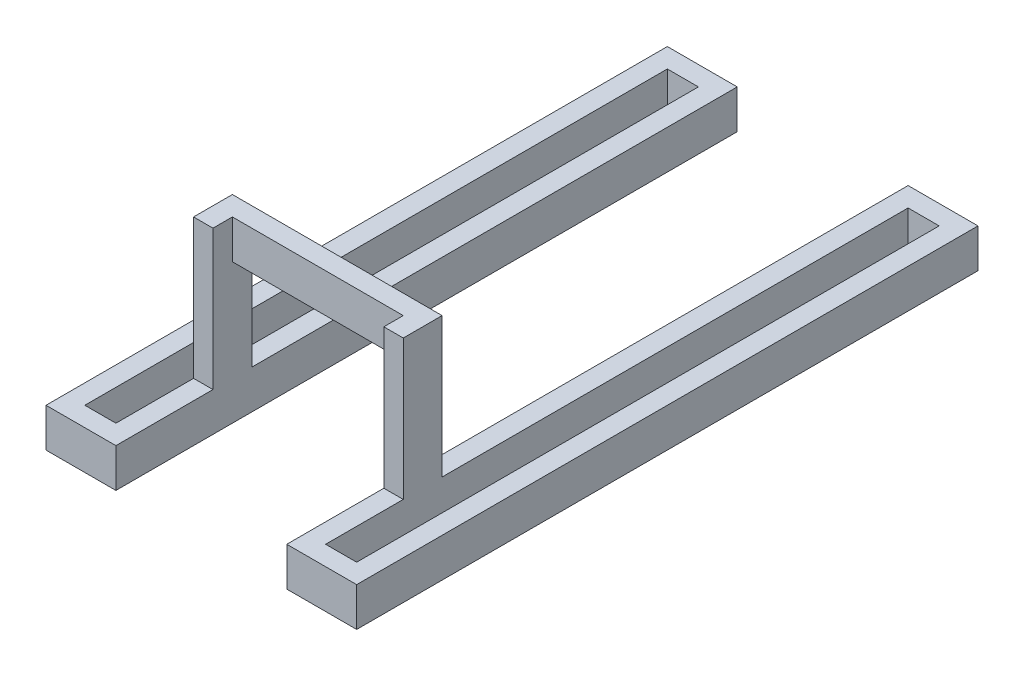
ISO-10303-21;
HEADER;
FILE_DESCRIPTION(('STEP AP214'),'2;1');
FILE_NAME('part.step','',(''),(''),'','','');
FILE_SCHEMA(('AUTOMOTIVE_DESIGN { 1 0 10303 214 1 1 1 1 }'));
ENDSEC;
DATA;
#1=APPLICATION_CONTEXT('core data for automotive mechanical design processes');
#2=APPLICATION_PROTOCOL_DEFINITION('international standard','automotive_design',2000,#1);
#3=PRODUCT_CONTEXT('',#1,'mechanical');
#4=PRODUCT('Part','Part','',(#3));
#5=PRODUCT_RELATED_PRODUCT_CATEGORY('part','',(#4));
#6=PRODUCT_DEFINITION_FORMATION('','',#4);
#7=PRODUCT_DEFINITION_CONTEXT('part definition',#1,'design');
#8=PRODUCT_DEFINITION('design','',#6,#7);
#9=PRODUCT_DEFINITION_SHAPE('','',#8);
#10=(LENGTH_UNIT() NAMED_UNIT(*) SI_UNIT(.MILLI.,.METRE.));
#11=(NAMED_UNIT(*) PLANE_ANGLE_UNIT() SI_UNIT($,.RADIAN.));
#12=(NAMED_UNIT(*) SI_UNIT($,.STERADIAN.) SOLID_ANGLE_UNIT());
#13=UNCERTAINTY_MEASURE_WITH_UNIT(LENGTH_MEASURE(1.E-05),#10,'distance_accuracy_value','');
#14=(GEOMETRIC_REPRESENTATION_CONTEXT(3) GLOBAL_UNCERTAINTY_ASSIGNED_CONTEXT((#13)) GLOBAL_UNIT_ASSIGNED_CONTEXT((#10,
#11,#12)) REPRESENTATION_CONTEXT('',''));
#15=CARTESIAN_POINT('',(0.,0.,0.));
#16=DIRECTION('',(0.,0.,1.));
#17=DIRECTION('',(1.,0.,0.));
#18=AXIS2_PLACEMENT_3D('',#15,#16,#17);
#19=CARTESIAN_POINT('',(-135.,180.,-55.9016994374948));
#20=DIRECTION('',(0.,-1.,0.));
#21=DIRECTION('',(0.,0.,-1.));
#22=AXIS2_PLACEMENT_3D('',#19,#20,#21);
#23=PLANE('',#22);
#24=DIRECTION('',(0.,0.,-1.));
#25=VECTOR('',#24,1.);
#26=CARTESIAN_POINT('',(110.,180.,-55.9016994374948));
#27=LINE('',#26,#25);
#28=CARTESIAN_POINT('',(110.,180.,650.));
#29=VERTEX_POINT('',#28);
#30=CARTESIAN_POINT('',(110.,180.,625.));
#31=VERTEX_POINT('',#30);
#32=EDGE_CURVE('E408',#29,#31,#27,.T.);
#33=ORIENTED_EDGE('',*,*,#32,.F.);
#34=DIRECTION('',(1.,0.,0.));
#35=VECTOR('',#34,1.);
#36=CARTESIAN_POINT('',(-190.901699437495,180.,650.));
#37=LINE('',#36,#35);
#38=CARTESIAN_POINT('',(-110.,180.,650.));
#39=VERTEX_POINT('',#38);
#40=EDGE_CURVE('E365',#39,#29,#37,.T.);
#41=ORIENTED_EDGE('',*,*,#40,.F.);
#42=DIRECTION('',(0.,0.,1.));
#43=VECTOR('',#42,1.);
#44=CARTESIAN_POINT('',(-110.,180.,-55.9016994374948));
#45=LINE('',#44,#43);
#46=CARTESIAN_POINT('',(-110.,180.,625.));
#47=VERTEX_POINT('',#46);
#48=EDGE_CURVE('E11',#47,#39,#45,.T.);
#49=ORIENTED_EDGE('',*,*,#48,.F.);
#50=DIRECTION('',(1.,0.,0.));
#51=VECTOR('',#50,1.);
#52=CARTESIAN_POINT('',(-190.901699437495,180.,625.));
#53=LINE('',#52,#51);
#54=EDGE_CURVE('E372',#47,#31,#53,.T.);
#55=ORIENTED_EDGE('',*,*,#54,.T.);
#56=EDGE_LOOP('',(#33,#41,#49,#55));
#57=FACE_BOUND('',#56,.T.);
#58=ADVANCED_FACE('F32',(#57),#23,.T.);
#59=CARTESIAN_POINT('',(-190.901699437495,230.,650.));
#60=DIRECTION('',(0.,0.,1.));
#61=DIRECTION('',(1.,0.,0.));
#62=AXIS2_PLACEMENT_3D('',#59,#60,#61);
#63=PLANE('',#62);
#64=ORIENTED_EDGE('',*,*,#40,.T.);
#65=DIRECTION('',(0.,1.,0.));
#66=VECTOR('',#65,1.);
#67=CARTESIAN_POINT('',(110.,230.,650.));
#68=LINE('',#67,#66);
#69=CARTESIAN_POINT('',(110.,230.,650.));
#70=VERTEX_POINT('',#69);
#71=EDGE_CURVE('E359',#29,#70,#68,.T.);
#72=ORIENTED_EDGE('',*,*,#71,.T.);
#73=DIRECTION('',(1.,0.,0.));
#74=VECTOR('',#73,1.);
#75=CARTESIAN_POINT('',(-190.901699437495,230.,650.));
#76=LINE('',#75,#74);
#77=CARTESIAN_POINT('',(-110.,230.,650.));
#78=VERTEX_POINT('',#77);
#79=EDGE_CURVE('E366',#78,#70,#76,.T.);
#80=ORIENTED_EDGE('',*,*,#79,.F.);
#81=DIRECTION('',(0.,1.,0.));
#82=VECTOR('',#81,1.);
#83=CARTESIAN_POINT('',(-110.,50.,650.));
#84=LINE('',#83,#82);
#85=EDGE_CURVE('E369',#39,#78,#84,.T.);
#86=ORIENTED_EDGE('',*,*,#85,.F.);
#87=EDGE_LOOP('',(#64,#72,#80,#86));
#88=FACE_BOUND('',#87,.T.);
#89=ADVANCED_FACE('F446',(#88),#63,.T.);
#90=CARTESIAN_POINT('',(-190.901699437495,230.,625.));
#91=DIRECTION('',(0.,0.,-1.));
#92=DIRECTION('',(-1.,0.,0.));
#93=AXIS2_PLACEMENT_3D('',#90,#91,#92);
#94=PLANE('',#93);
#95=DIRECTION('',(1.,0.,0.));
#96=VECTOR('',#95,1.);
#97=CARTESIAN_POINT('',(-190.901699437495,230.,625.));
#98=LINE('',#97,#96);
#99=CARTESIAN_POINT('',(-135.,230.,625.));
#100=VERTEX_POINT('',#99);
#101=CARTESIAN_POINT('',(135.,230.,625.));
#102=VERTEX_POINT('',#101);
#103=EDGE_CURVE('E370',#100,#102,#98,.T.);
#104=ORIENTED_EDGE('',*,*,#103,.T.);
#105=DIRECTION('',(0.,1.,0.));
#106=VECTOR('',#105,1.);
#107=CARTESIAN_POINT('',(135.,-5.90169943749475,625.));
#108=LINE('',#107,#106);
#109=CARTESIAN_POINT('',(135.,50.,625.));
#110=VERTEX_POINT('',#109);
#111=EDGE_CURVE('E403',#110,#102,#108,.T.);
#112=ORIENTED_EDGE('',*,*,#111,.F.);
#113=DIRECTION('',(-1.,0.,0.));
#114=VECTOR('',#113,1.);
#115=CARTESIAN_POINT('',(135.,50.,625.));
#116=LINE('',#115,#114);
#117=CARTESIAN_POINT('',(110.,50.,625.));
#118=VERTEX_POINT('',#117);
#119=EDGE_CURVE('E406',#110,#118,#116,.T.);
#120=ORIENTED_EDGE('',*,*,#119,.T.);
#121=DIRECTION('',(0.,1.,0.));
#122=VECTOR('',#121,1.);
#123=CARTESIAN_POINT('',(110.,-5.90169943749475,625.));
#124=LINE('',#123,#122);
#125=EDGE_CURVE('E415',#118,#31,#124,.T.);
#126=ORIENTED_EDGE('',*,*,#125,.T.);
#127=ORIENTED_EDGE('',*,*,#54,.F.);
#128=DIRECTION('',(0.,1.,0.));
#129=VECTOR('',#128,1.);
#130=CARTESIAN_POINT('',(-110.,-5.9016994374948,625.));
#131=LINE('',#130,#129);
#132=CARTESIAN_POINT('',(-110.,50.,625.));
#133=VERTEX_POINT('',#132);
#134=EDGE_CURVE('E287',#133,#47,#131,.T.);
#135=ORIENTED_EDGE('',*,*,#134,.F.);
#136=DIRECTION('',(-1.,0.,0.));
#137=VECTOR('',#136,1.);
#138=CARTESIAN_POINT('',(-110.,50.,625.));
#139=LINE('',#138,#137);
#140=CARTESIAN_POINT('',(-135.,50.,625.));
#141=VERTEX_POINT('',#140);
#142=EDGE_CURVE('E284',#133,#141,#139,.T.);
#143=ORIENTED_EDGE('',*,*,#142,.T.);
#144=DIRECTION('',(0.,1.,0.));
#145=VECTOR('',#144,1.);
#146=CARTESIAN_POINT('',(-135.,-5.9016994374948,625.));
#147=LINE('',#146,#145);
#148=EDGE_CURVE('E55',#141,#100,#147,.T.);
#149=ORIENTED_EDGE('',*,*,#148,.T.);
#150=EDGE_LOOP('',(#104,#112,#120,#126,#127,#135,#143,#149));
#151=FACE_BOUND('',#150,.T.);
#152=ADVANCED_FACE('F401',(#151),#94,.T.);
#153=CARTESIAN_POINT('',(-200.,50.,800.));
#154=DIRECTION('',(1.,0.,0.));
#155=DIRECTION('',(0.,0.,-1.));
#156=AXIS2_PLACEMENT_3D('',#153,#154,#155);
#157=PLANE('',#156);
#158=DIRECTION('',(0.,-1.,0.));
#159=VECTOR('',#158,1.);
#160=CARTESIAN_POINT('',(-200.,50.,0.));
#161=LINE('',#160,#159);
#162=CARTESIAN_POINT('',(-200.,50.,0.));
#163=VERTEX_POINT('',#162);
#164=CARTESIAN_POINT('',(-200.,0.,0.));
#165=VERTEX_POINT('',#164);
#166=EDGE_CURVE('E258',#163,#165,#161,.T.);
#167=ORIENTED_EDGE('',*,*,#166,.T.);
#168=DIRECTION('',(0.,0.,-1.));
#169=VECTOR('',#168,1.);
#170=CARTESIAN_POINT('',(-200.,0.,800.));
#171=LINE('',#170,#169);
#172=CARTESIAN_POINT('',(-200.,0.,800.));
#173=VERTEX_POINT('',#172);
#174=EDGE_CURVE('E40',#173,#165,#171,.T.);
#175=ORIENTED_EDGE('',*,*,#174,.F.);
#176=DIRECTION('',(0.,-1.,0.));
#177=VECTOR('',#176,1.);
#178=CARTESIAN_POINT('',(-200.,50.,800.));
#179=LINE('',#178,#177);
#180=CARTESIAN_POINT('',(-200.,50.,800.));
#181=VERTEX_POINT('',#180);
#182=EDGE_CURVE('E259',#181,#173,#179,.T.);
#183=ORIENTED_EDGE('',*,*,#182,.F.);
#184=DIRECTION('',(0.,0.,-1.));
#185=VECTOR('',#184,1.);
#186=CARTESIAN_POINT('',(-200.,50.,800.));
#187=LINE('',#186,#185);
#188=EDGE_CURVE('E213',#181,#163,#187,.T.);
#189=ORIENTED_EDGE('',*,*,#188,.T.);
#190=EDGE_LOOP('',(#167,#175,#183,#189));
#191=FACE_BOUND('',#190,.T.);
#192=ADVANCED_FACE('F34',(#191),#157,.F.);
#193=CARTESIAN_POINT('',(-200.,0.,800.));
#194=DIRECTION('',(0.,1.,0.));
#195=DIRECTION('',(0.,0.,1.));
#196=AXIS2_PLACEMENT_3D('',#193,#194,#195);
#197=PLANE('',#196);
#198=ORIENTED_EDGE('',*,*,#174,.T.);
#199=DIRECTION('',(1.,0.,0.));
#200=VECTOR('',#199,1.);
#201=CARTESIAN_POINT('',(-200.,0.,0.));
#202=LINE('',#201,#200);
#203=CARTESIAN_POINT('',(-110.,0.,0.));
#204=VERTEX_POINT('',#203);
#205=EDGE_CURVE('E265',#165,#204,#202,.T.);
#206=ORIENTED_EDGE('',*,*,#205,.T.);
#207=DIRECTION('',(0.,0.,-1.));
#208=VECTOR('',#207,1.);
#209=CARTESIAN_POINT('',(-110.,0.,800.));
#210=LINE('',#209,#208);
#211=CARTESIAN_POINT('',(-110.,0.,800.));
#212=VERTEX_POINT('',#211);
#213=EDGE_CURVE('E227',#212,#204,#210,.T.);
#214=ORIENTED_EDGE('',*,*,#213,.F.);
#215=DIRECTION('',(1.,0.,0.));
#216=VECTOR('',#215,1.);
#217=CARTESIAN_POINT('',(-200.,0.,800.));
#218=LINE('',#217,#216);
#219=EDGE_CURVE('E218',#173,#212,#218,.T.);
#220=ORIENTED_EDGE('',*,*,#219,.F.);
#221=EDGE_LOOP('',(#198,#206,#214,#220));
#222=FACE_BOUND('',#221,.T.);
#223=DIRECTION('',(0.,0.,-1.));
#224=VECTOR('',#223,1.);
#225=CARTESIAN_POINT('',(-175.,0.,800.));
#226=LINE('',#225,#224);
#227=CARTESIAN_POINT('',(-175.,0.,775.));
#228=VERTEX_POINT('',#227);
#229=CARTESIAN_POINT('',(-175.,0.,25.));
#230=VERTEX_POINT('',#229);
#231=EDGE_CURVE('E271',#228,#230,#226,.T.);
#232=ORIENTED_EDGE('',*,*,#231,.F.);
#233=DIRECTION('',(-1.,0.,0.));
#234=VECTOR('',#233,1.);
#235=CARTESIAN_POINT('',(-79.0983005625052,0.,775.));
#236=LINE('',#235,#234);
#237=CARTESIAN_POINT('',(-135.,0.,775.));
#238=VERTEX_POINT('',#237);
#239=EDGE_CURVE('E381',#238,#228,#236,.T.);
#240=ORIENTED_EDGE('',*,*,#239,.F.);
#241=DIRECTION('',(0.,0.,-1.));
#242=VECTOR('',#241,1.);
#243=CARTESIAN_POINT('',(-135.,0.,800.));
#244=LINE('',#243,#242);
#245=CARTESIAN_POINT('',(-135.,0.,25.));
#246=VERTEX_POINT('',#245);
#247=EDGE_CURVE('E244',#238,#246,#244,.T.);
#248=ORIENTED_EDGE('',*,*,#247,.T.);
#249=DIRECTION('',(-1.,0.,0.));
#250=VECTOR('',#249,1.);
#251=CARTESIAN_POINT('',(-79.0983005625052,0.,25.));
#252=LINE('',#251,#250);
#253=EDGE_CURVE('E246',#246,#230,#252,.T.);
#254=ORIENTED_EDGE('',*,*,#253,.T.);
#255=EDGE_LOOP('',(#232,#240,#248,#254));
#256=FACE_BOUND('',#255,.T.);
#257=ADVANCED_FACE('F275',(#222,#256),#197,.F.);
#258=CARTESIAN_POINT('',(-175.,50.,800.));
#259=DIRECTION('',(-1.,0.,0.));
#260=DIRECTION('',(0.,-1.,0.));
#261=AXIS2_PLACEMENT_3D('',#258,#259,#260);
#262=PLANE('',#261);
#263=DIRECTION('',(0.,0.,-1.));
#264=VECTOR('',#263,1.);
#265=CARTESIAN_POINT('',(-175.,50.,800.));
#266=LINE('',#265,#264);
#267=CARTESIAN_POINT('',(-175.,50.,775.));
#268=VERTEX_POINT('',#267);
#269=CARTESIAN_POINT('',(-175.,50.,25.));
#270=VERTEX_POINT('',#269);
#271=EDGE_CURVE('E269',#268,#270,#266,.T.);
#272=ORIENTED_EDGE('',*,*,#271,.F.);
#273=DIRECTION('',(0.,-1.,0.));
#274=VECTOR('',#273,1.);
#275=CARTESIAN_POINT('',(-175.,50.,775.));
#276=LINE('',#275,#274);
#277=EDGE_CURVE('E385',#268,#228,#276,.T.);
#278=ORIENTED_EDGE('',*,*,#277,.T.);
#279=ORIENTED_EDGE('',*,*,#231,.T.);
#280=DIRECTION('',(0.,1.,0.));
#281=VECTOR('',#280,1.);
#282=CARTESIAN_POINT('',(-175.,49.9999999999999,25.));
#283=LINE('',#282,#281);
#284=EDGE_CURVE('E253',#230,#270,#283,.T.);
#285=ORIENTED_EDGE('',*,*,#284,.T.);
#286=EDGE_LOOP('',(#272,#278,#279,#285));
#287=FACE_BOUND('',#286,.T.);
#288=ADVANCED_FACE('F432',(#287),#262,.F.);
#289=CARTESIAN_POINT('',(-200.,50.,800.));
#290=DIRECTION('',(0.,-1.,0.));
#291=DIRECTION('',(1.,0.,0.));
#292=AXIS2_PLACEMENT_3D('',#289,#290,#291);
#293=PLANE('',#292);
#294=ORIENTED_EDGE('',*,*,#271,.T.);
#295=DIRECTION('',(-1.,0.,0.));
#296=VECTOR('',#295,1.);
#297=CARTESIAN_POINT('',(-79.0983005625052,50.,25.));
#298=LINE('',#297,#296);
#299=CARTESIAN_POINT('',(-135.,50.,25.));
#300=VERTEX_POINT('',#299);
#301=EDGE_CURVE('E250',#300,#270,#298,.T.);
#302=ORIENTED_EDGE('',*,*,#301,.F.);
#303=DIRECTION('',(0.,0.,-1.));
#304=VECTOR('',#303,1.);
#305=CARTESIAN_POINT('',(-135.,50.,800.));
#306=LINE('',#305,#304);
#307=EDGE_CURVE('E232',#141,#300,#306,.T.);
#308=ORIENTED_EDGE('',*,*,#307,.F.);
#309=ORIENTED_EDGE('',*,*,#142,.F.);
#310=DIRECTION('',(0.,0.,-1.));
#311=VECTOR('',#310,1.);
#312=CARTESIAN_POINT('',(-110.,50.,800.));
#313=LINE('',#312,#311);
#314=CARTESIAN_POINT('',(-110.,50.,0.));
#315=VERTEX_POINT('',#314);
#316=EDGE_CURVE('E228',#133,#315,#313,.T.);
#317=ORIENTED_EDGE('',*,*,#316,.T.);
#318=DIRECTION('',(-1.,0.,0.));
#319=VECTOR('',#318,1.);
#320=CARTESIAN_POINT('',(-200.,50.,0.));
#321=LINE('',#320,#319);
#322=EDGE_CURVE('E261',#315,#163,#321,.T.);
#323=ORIENTED_EDGE('',*,*,#322,.T.);
#324=ORIENTED_EDGE('',*,*,#188,.F.);
#325=DIRECTION('',(-1.,0.,0.));
#326=VECTOR('',#325,1.);
#327=CARTESIAN_POINT('',(-200.,50.,800.));
#328=LINE('',#327,#326);
#329=CARTESIAN_POINT('',(-110.,50.,800.));
#330=VERTEX_POINT('',#329);
#331=EDGE_CURVE('E208',#330,#181,#328,.T.);
#332=ORIENTED_EDGE('',*,*,#331,.F.);
#333=CARTESIAN_POINT('',(-110.,50.,675.));
#334=VERTEX_POINT('',#333);
#335=EDGE_CURVE('E211',#330,#334,#313,.T.);
#336=ORIENTED_EDGE('',*,*,#335,.T.);
#337=DIRECTION('',(1.,0.,0.));
#338=VECTOR('',#337,1.);
#339=CARTESIAN_POINT('',(-110.,50.,675.));
#340=LINE('',#339,#338);
#341=CARTESIAN_POINT('',(-135.,50.,675.));
#342=VERTEX_POINT('',#341);
#343=EDGE_CURVE('E295',#342,#334,#340,.T.);
#344=ORIENTED_EDGE('',*,*,#343,.F.);
#345=CARTESIAN_POINT('',(-135.,50.,775.));
#346=VERTEX_POINT('',#345);
#347=EDGE_CURVE('E235',#346,#342,#306,.T.);
#348=ORIENTED_EDGE('',*,*,#347,.F.);
#349=DIRECTION('',(-1.,0.,0.));
#350=VECTOR('',#349,1.);
#351=CARTESIAN_POINT('',(-79.0983005625052,50.,775.));
#352=LINE('',#351,#350);
#353=EDGE_CURVE('E378',#346,#268,#352,.T.);
#354=ORIENTED_EDGE('',*,*,#353,.T.);
#355=EDGE_LOOP('',(#294,#302,#308,#309,#317,#323,#324,#332,#336,#344,#348,#354));
#356=FACE_BOUND('',#355,.T.);
#357=ADVANCED_FACE('F210',(#356),#293,.F.);
#358=CARTESIAN_POINT('',(0.,0.,800.));
#359=DIRECTION('',(0.,0.,1.));
#360=DIRECTION('',(1.,0.,0.));
#361=AXIS2_PLACEMENT_3D('',#358,#359,#360);
#362=PLANE('',#361);
#363=DIRECTION('',(0.,1.,0.));
#364=VECTOR('',#363,1.);
#365=CARTESIAN_POINT('',(-110.,50.,800.));
#366=LINE('',#365,#364);
#367=EDGE_CURVE('E225',#212,#330,#366,.T.);
#368=ORIENTED_EDGE('',*,*,#367,.T.);
#369=ORIENTED_EDGE('',*,*,#331,.T.);
#370=ORIENTED_EDGE('',*,*,#182,.T.);
#371=ORIENTED_EDGE('',*,*,#219,.T.);
#372=EDGE_LOOP('',(#368,#369,#370,#371));
#373=FACE_BOUND('',#372,.T.);
#374=ADVANCED_FACE('F230',(#373),#362,.T.);
#375=CARTESIAN_POINT('',(0.,0.,0.));
#376=DIRECTION('',(0.,0.,1.));
#377=DIRECTION('',(1.,0.,0.));
#378=AXIS2_PLACEMENT_3D('',#375,#376,#377);
#379=PLANE('',#378);
#380=ORIENTED_EDGE('',*,*,#322,.F.);
#381=DIRECTION('',(0.,1.,0.));
#382=VECTOR('',#381,1.);
#383=CARTESIAN_POINT('',(-110.,50.,0.));
#384=LINE('',#383,#382);
#385=EDGE_CURVE('E233',#204,#315,#384,.T.);
#386=ORIENTED_EDGE('',*,*,#385,.F.);
#387=ORIENTED_EDGE('',*,*,#205,.F.);
#388=ORIENTED_EDGE('',*,*,#166,.F.);
#389=EDGE_LOOP('',(#380,#386,#387,#388));
#390=FACE_BOUND('',#389,.T.);
#391=ADVANCED_FACE('F281',(#390),#379,.F.);
#392=CARTESIAN_POINT('',(-79.0983005625052,50.,25.));
#393=DIRECTION('',(0.,0.,1.));
#394=DIRECTION('',(0.,-1.,0.));
#395=AXIS2_PLACEMENT_3D('',#392,#393,#394);
#396=PLANE('',#395);
#397=ORIENTED_EDGE('',*,*,#284,.F.);
#398=ORIENTED_EDGE('',*,*,#253,.F.);
#399=DIRECTION('',(0.,1.,0.));
#400=VECTOR('',#399,1.);
#401=CARTESIAN_POINT('',(-135.,50.,25.));
#402=LINE('',#401,#400);
#403=EDGE_CURVE('E247',#246,#300,#402,.T.);
#404=ORIENTED_EDGE('',*,*,#403,.T.);
#405=ORIENTED_EDGE('',*,*,#301,.T.);
#406=EDGE_LOOP('',(#397,#398,#404,#405));
#407=FACE_BOUND('',#406,.T.);
#408=ADVANCED_FACE('F434',(#407),#396,.T.);
#409=CARTESIAN_POINT('',(-135.,50.,800.));
#410=DIRECTION('',(1.,0.,0.));
#411=DIRECTION('',(0.,0.,-1.));
#412=AXIS2_PLACEMENT_3D('',#409,#410,#411);
#413=PLANE('',#412);
#414=DIRECTION('',(0.,0.,-1.));
#415=VECTOR('',#414,1.);
#416=CARTESIAN_POINT('',(-135.,230.,800.));
#417=LINE('',#416,#415);
#418=CARTESIAN_POINT('',(-135.,230.,675.));
#419=VERTEX_POINT('',#418);
#420=EDGE_CURVE('E237',#419,#100,#417,.T.);
#421=ORIENTED_EDGE('',*,*,#420,.T.);
#422=ORIENTED_EDGE('',*,*,#148,.F.);
#423=ORIENTED_EDGE('',*,*,#307,.T.);
#424=ORIENTED_EDGE('',*,*,#403,.F.);
#425=ORIENTED_EDGE('',*,*,#247,.F.);
#426=DIRECTION('',(0.,-1.,0.));
#427=VECTOR('',#426,1.);
#428=CARTESIAN_POINT('',(-135.,50.,775.));
#429=LINE('',#428,#427);
#430=EDGE_CURVE('E379',#346,#238,#429,.T.);
#431=ORIENTED_EDGE('',*,*,#430,.F.);
#432=ORIENTED_EDGE('',*,*,#347,.T.);
#433=DIRECTION('',(0.,1.,0.));
#434=VECTOR('',#433,1.);
#435=CARTESIAN_POINT('',(-135.,-5.9016994374948,675.));
#436=LINE('',#435,#434);
#437=EDGE_CURVE('E394',#342,#419,#436,.T.);
#438=ORIENTED_EDGE('',*,*,#437,.T.);
#439=EDGE_LOOP('',(#421,#422,#423,#424,#425,#431,#432,#438));
#440=FACE_BOUND('',#439,.T.);
#441=ADVANCED_FACE('F392',(#440),#413,.F.);
#442=CARTESIAN_POINT('',(-110.,50.,800.));
#443=DIRECTION('',(-1.,0.,0.));
#444=DIRECTION('',(0.,0.,1.));
#445=AXIS2_PLACEMENT_3D('',#442,#443,#444);
#446=PLANE('',#445);
#447=ORIENTED_EDGE('',*,*,#385,.T.);
#448=ORIENTED_EDGE('',*,*,#316,.F.);
#449=ORIENTED_EDGE('',*,*,#134,.T.);
#450=ORIENTED_EDGE('',*,*,#48,.T.);
#451=ORIENTED_EDGE('',*,*,#85,.T.);
#452=DIRECTION('',(0.,0.,1.));
#453=VECTOR('',#452,1.);
#454=CARTESIAN_POINT('',(-110.,230.,0.));
#455=LINE('',#454,#453);
#456=CARTESIAN_POINT('',(-110.,230.,675.));
#457=VERTEX_POINT('',#456);
#458=EDGE_CURVE('E387',#78,#457,#455,.T.);
#459=ORIENTED_EDGE('',*,*,#458,.T.);
#460=DIRECTION('',(0.,1.,0.));
#461=VECTOR('',#460,1.);
#462=CARTESIAN_POINT('',(-110.,-5.9016994374948,675.));
#463=LINE('',#462,#461);
#464=EDGE_CURVE('E47',#334,#457,#463,.T.);
#465=ORIENTED_EDGE('',*,*,#464,.F.);
#466=ORIENTED_EDGE('',*,*,#335,.F.);
#467=ORIENTED_EDGE('',*,*,#367,.F.);
#468=ORIENTED_EDGE('',*,*,#213,.T.);
#469=EDGE_LOOP('',(#447,#448,#449,#450,#451,#459,#465,#466,#467,#468));
#470=FACE_BOUND('',#469,.T.);
#471=ADVANCED_FACE('F223',(#470),#446,.F.);
#472=CARTESIAN_POINT('',(0.,230.,0.));
#473=DIRECTION('',(0.,-1.,0.));
#474=DIRECTION('',(1.,0.,0.));
#475=AXIS2_PLACEMENT_3D('',#472,#473,#474);
#476=PLANE('',#475);
#477=DIRECTION('',(0.,0.,1.));
#478=VECTOR('',#477,1.);
#479=CARTESIAN_POINT('',(135.,230.,650.));
#480=LINE('',#479,#478);
#481=CARTESIAN_POINT('',(135.,230.,675.));
#482=VERTEX_POINT('',#481);
#483=EDGE_CURVE('E362',#102,#482,#480,.T.);
#484=ORIENTED_EDGE('',*,*,#483,.F.);
#485=ORIENTED_EDGE('',*,*,#103,.F.);
#486=ORIENTED_EDGE('',*,*,#420,.F.);
#487=DIRECTION('',(1.,0.,0.));
#488=VECTOR('',#487,1.);
#489=CARTESIAN_POINT('',(-200.,230.,675.));
#490=LINE('',#489,#488);
#491=EDGE_CURVE('E398',#419,#457,#490,.T.);
#492=ORIENTED_EDGE('',*,*,#491,.T.);
#493=ORIENTED_EDGE('',*,*,#458,.F.);
#494=ORIENTED_EDGE('',*,*,#79,.T.);
#495=DIRECTION('',(0.,0.,-1.));
#496=VECTOR('',#495,1.);
#497=CARTESIAN_POINT('',(110.,230.,0.));
#498=LINE('',#497,#496);
#499=CARTESIAN_POINT('',(110.,230.,675.));
#500=VERTEX_POINT('',#499);
#501=EDGE_CURVE('E307',#500,#70,#498,.T.);
#502=ORIENTED_EDGE('',*,*,#501,.F.);
#503=EDGE_CURVE('E844',#500,#482,#490,.T.);
#504=ORIENTED_EDGE('',*,*,#503,.T.);
#505=EDGE_LOOP('',(#484,#485,#486,#492,#493,#494,#502,#504));
#506=FACE_BOUND('',#505,.T.);
#507=ADVANCED_FACE('F397',(#506),#476,.F.);
#508=CARTESIAN_POINT('',(-79.0983005625052,50.,775.));
#509=DIRECTION('',(0.,0.,-1.));
#510=DIRECTION('',(-1.,0.,0.));
#511=AXIS2_PLACEMENT_3D('',#508,#509,#510);
#512=PLANE('',#511);
#513=ORIENTED_EDGE('',*,*,#277,.F.);
#514=ORIENTED_EDGE('',*,*,#353,.F.);
#515=ORIENTED_EDGE('',*,*,#430,.T.);
#516=ORIENTED_EDGE('',*,*,#239,.T.);
#517=EDGE_LOOP('',(#513,#514,#515,#516));
#518=FACE_BOUND('',#517,.T.);
#519=ADVANCED_FACE('F426',(#518),#512,.T.);
#520=CARTESIAN_POINT('',(135.,0.,0.));
#521=DIRECTION('',(1.,0.,0.));
#522=DIRECTION('',(0.,0.,-1.));
#523=AXIS2_PLACEMENT_3D('',#520,#521,#522);
#524=PLANE('',#523);
#525=ORIENTED_EDGE('',*,*,#111,.T.);
#526=ORIENTED_EDGE('',*,*,#483,.T.);
#527=DIRECTION('',(0.,1.,0.));
#528=VECTOR('',#527,1.);
#529=CARTESIAN_POINT('',(135.,-5.90169943749475,675.));
#530=LINE('',#529,#528);
#531=CARTESIAN_POINT('',(135.,50.,675.));
#532=VERTEX_POINT('',#531);
#533=EDGE_CURVE('E409',#532,#482,#530,.T.);
#534=ORIENTED_EDGE('',*,*,#533,.F.);
#535=DIRECTION('',(0.,0.,-1.));
#536=VECTOR('',#535,1.);
#537=CARTESIAN_POINT('',(135.,50.,800.));
#538=LINE('',#537,#536);
#539=CARTESIAN_POINT('',(135.,50.,775.));
#540=VERTEX_POINT('',#539);
#541=EDGE_CURVE('E318',#540,#532,#538,.T.);
#542=ORIENTED_EDGE('',*,*,#541,.F.);
#543=DIRECTION('',(0.,1.,0.));
#544=VECTOR('',#543,1.);
#545=CARTESIAN_POINT('',(135.,50.,775.));
#546=LINE('',#545,#544);
#547=CARTESIAN_POINT('',(135.,0.,775.));
#548=VERTEX_POINT('',#547);
#549=EDGE_CURVE('E326',#548,#540,#546,.T.);
#550=ORIENTED_EDGE('',*,*,#549,.F.);
#551=DIRECTION('',(0.,0.,-1.));
#552=VECTOR('',#551,1.);
#553=CARTESIAN_POINT('',(135.,0.,800.));
#554=LINE('',#553,#552);
#555=CARTESIAN_POINT('',(135.,0.,25.));
#556=VERTEX_POINT('',#555);
#557=EDGE_CURVE('E320',#548,#556,#554,.T.);
#558=ORIENTED_EDGE('',*,*,#557,.T.);
#559=DIRECTION('',(0.,-1.,0.));
#560=VECTOR('',#559,1.);
#561=CARTESIAN_POINT('',(135.,50.,25.));
#562=LINE('',#561,#560);
#563=CARTESIAN_POINT('',(135.,50.,25.));
#564=VERTEX_POINT('',#563);
#565=EDGE_CURVE('E293',#564,#556,#562,.T.);
#566=ORIENTED_EDGE('',*,*,#565,.F.);
#567=EDGE_CURVE('E317',#110,#564,#538,.T.);
#568=ORIENTED_EDGE('',*,*,#567,.F.);
#569=EDGE_LOOP('',(#525,#526,#534,#542,#550,#558,#566,#568));
#570=FACE_BOUND('',#569,.T.);
#571=ADVANCED_FACE('F458',(#570),#524,.T.);
#572=CARTESIAN_POINT('',(175.,50.,800.));
#573=DIRECTION('',(1.,0.,0.));
#574=DIRECTION('',(0.,1.,0.));
#575=AXIS2_PLACEMENT_3D('',#572,#573,#574);
#576=PLANE('',#575);
#577=DIRECTION('',(0.,0.,-1.));
#578=VECTOR('',#577,1.);
#579=CARTESIAN_POINT('',(175.,50.,800.));
#580=LINE('',#579,#578);
#581=CARTESIAN_POINT('',(175.,50.,775.));
#582=VERTEX_POINT('',#581);
#583=CARTESIAN_POINT('',(175.,50.,25.));
#584=VERTEX_POINT('',#583);
#585=EDGE_CURVE('E344',#582,#584,#580,.T.);
#586=ORIENTED_EDGE('',*,*,#585,.T.);
#587=DIRECTION('',(0.,-1.,0.));
#588=VECTOR('',#587,1.);
#589=CARTESIAN_POINT('',(175.,50.0000000000001,25.));
#590=LINE('',#589,#588);
#591=CARTESIAN_POINT('',(175.,0.,25.));
#592=VERTEX_POINT('',#591);
#593=EDGE_CURVE('E304',#584,#592,#590,.T.);
#594=ORIENTED_EDGE('',*,*,#593,.T.);
#595=DIRECTION('',(0.,0.,-1.));
#596=VECTOR('',#595,1.);
#597=CARTESIAN_POINT('',(175.,0.,800.));
#598=LINE('',#597,#596);
#599=CARTESIAN_POINT('',(175.,0.,775.));
#600=VERTEX_POINT('',#599);
#601=EDGE_CURVE('E356',#600,#592,#598,.T.);
#602=ORIENTED_EDGE('',*,*,#601,.F.);
#603=DIRECTION('',(0.,1.,0.));
#604=VECTOR('',#603,1.);
#605=CARTESIAN_POINT('',(175.,50.,775.));
#606=LINE('',#605,#604);
#607=EDGE_CURVE('E331',#600,#582,#606,.T.);
#608=ORIENTED_EDGE('',*,*,#607,.T.);
#609=EDGE_LOOP('',(#586,#594,#602,#608));
#610=FACE_BOUND('',#609,.T.);
#611=ADVANCED_FACE('F480',(#610),#576,.F.);
#612=CARTESIAN_POINT('',(175.,0.,800.));
#613=DIRECTION('',(0.,1.,0.));
#614=DIRECTION('',(0.,0.,1.));
#615=AXIS2_PLACEMENT_3D('',#612,#613,#614);
#616=PLANE('',#615);
#617=DIRECTION('',(0.,0.,-1.));
#618=VECTOR('',#617,1.);
#619=CARTESIAN_POINT('',(110.,0.,800.));
#620=LINE('',#619,#618);
#621=CARTESIAN_POINT('',(110.,0.,800.));
#622=VERTEX_POINT('',#621);
#623=CARTESIAN_POINT('',(110.,0.,0.));
#624=VERTEX_POINT('',#623);
#625=EDGE_CURVE('E322',#622,#624,#620,.T.);
#626=ORIENTED_EDGE('',*,*,#625,.T.);
#627=DIRECTION('',(1.,0.,0.));
#628=VECTOR('',#627,1.);
#629=CARTESIAN_POINT('',(175.,0.,0.));
#630=LINE('',#629,#628);
#631=CARTESIAN_POINT('',(200.,0.,0.));
#632=VERTEX_POINT('',#631);
#633=EDGE_CURVE('E336',#624,#632,#630,.T.);
#634=ORIENTED_EDGE('',*,*,#633,.T.);
#635=DIRECTION('',(0.,0.,-1.));
#636=VECTOR('',#635,1.);
#637=CARTESIAN_POINT('',(200.,0.,800.));
#638=LINE('',#637,#636);
#639=CARTESIAN_POINT('',(200.,0.,800.));
#640=VERTEX_POINT('',#639);
#641=EDGE_CURVE('E354',#640,#632,#638,.T.);
#642=ORIENTED_EDGE('',*,*,#641,.F.);
#643=DIRECTION('',(1.,0.,0.));
#644=VECTOR('',#643,1.);
#645=CARTESIAN_POINT('',(175.,0.,800.));
#646=LINE('',#645,#644);
#647=EDGE_CURVE('E337',#622,#640,#646,.T.);
#648=ORIENTED_EDGE('',*,*,#647,.F.);
#649=EDGE_LOOP('',(#626,#634,#642,#648));
#650=FACE_BOUND('',#649,.T.);
#651=ORIENTED_EDGE('',*,*,#601,.T.);
#652=DIRECTION('',(1.,0.,0.));
#653=VECTOR('',#652,1.);
#654=CARTESIAN_POINT('',(79.0983005625052,0.,25.));
#655=LINE('',#654,#653);
#656=EDGE_CURVE('E301',#556,#592,#655,.T.);
#657=ORIENTED_EDGE('',*,*,#656,.F.);
#658=ORIENTED_EDGE('',*,*,#557,.F.);
#659=DIRECTION('',(1.,0.,0.));
#660=VECTOR('',#659,1.);
#661=CARTESIAN_POINT('',(79.0983005625052,0.,775.));
#662=LINE('',#661,#660);
#663=EDGE_CURVE('E325',#548,#600,#662,.T.);
#664=ORIENTED_EDGE('',*,*,#663,.T.);
#665=EDGE_LOOP('',(#651,#657,#658,#664));
#666=FACE_BOUND('',#665,.T.);
#667=ADVANCED_FACE('F487',(#650,#666),#616,.F.);
#668=CARTESIAN_POINT('',(200.,50.,800.));
#669=DIRECTION('',(-1.,0.,0.));
#670=DIRECTION('',(0.,0.,1.));
#671=AXIS2_PLACEMENT_3D('',#668,#669,#670);
#672=PLANE('',#671);
#673=ORIENTED_EDGE('',*,*,#641,.T.);
#674=DIRECTION('',(0.,1.,0.));
#675=VECTOR('',#674,1.);
#676=CARTESIAN_POINT('',(200.,50.,0.));
#677=LINE('',#676,#675);
#678=CARTESIAN_POINT('',(200.,50.,0.));
#679=VERTEX_POINT('',#678);
#680=EDGE_CURVE('E347',#632,#679,#677,.T.);
#681=ORIENTED_EDGE('',*,*,#680,.T.);
#682=DIRECTION('',(0.,0.,-1.));
#683=VECTOR('',#682,1.);
#684=CARTESIAN_POINT('',(200.,50.,800.));
#685=LINE('',#684,#683);
#686=CARTESIAN_POINT('',(200.,50.,800.));
#687=VERTEX_POINT('',#686);
#688=EDGE_CURVE('E352',#687,#679,#685,.T.);
#689=ORIENTED_EDGE('',*,*,#688,.F.);
#690=DIRECTION('',(0.,1.,0.));
#691=VECTOR('',#690,1.);
#692=CARTESIAN_POINT('',(200.,50.,800.));
#693=LINE('',#692,#691);
#694=EDGE_CURVE('E339',#640,#687,#693,.T.);
#695=ORIENTED_EDGE('',*,*,#694,.F.);
#696=EDGE_LOOP('',(#673,#681,#689,#695));
#697=FACE_BOUND('',#696,.T.);
#698=ADVANCED_FACE('F496',(#697),#672,.F.);
#699=CARTESIAN_POINT('',(175.,50.,800.));
#700=DIRECTION('',(0.,-1.,0.));
#701=DIRECTION('',(0.,0.,-1.));
#702=AXIS2_PLACEMENT_3D('',#699,#700,#701);
#703=PLANE('',#702);
#704=ORIENTED_EDGE('',*,*,#688,.T.);
#705=DIRECTION('',(-1.,0.,0.));
#706=VECTOR('',#705,1.);
#707=CARTESIAN_POINT('',(175.,50.,0.));
#708=LINE('',#707,#706);
#709=CARTESIAN_POINT('',(110.,50.,0.));
#710=VERTEX_POINT('',#709);
#711=EDGE_CURVE('E340',#679,#710,#708,.T.);
#712=ORIENTED_EDGE('',*,*,#711,.T.);
#713=DIRECTION('',(0.,0.,-1.));
#714=VECTOR('',#713,1.);
#715=CARTESIAN_POINT('',(110.,50.,800.));
#716=LINE('',#715,#714);
#717=EDGE_CURVE('E312',#118,#710,#716,.T.);
#718=ORIENTED_EDGE('',*,*,#717,.F.);
#719=ORIENTED_EDGE('',*,*,#119,.F.);
#720=ORIENTED_EDGE('',*,*,#567,.T.);
#721=DIRECTION('',(1.,0.,0.));
#722=VECTOR('',#721,1.);
#723=CARTESIAN_POINT('',(79.0983005625052,50.,25.));
#724=LINE('',#723,#722);
#725=EDGE_CURVE('E290',#564,#584,#724,.T.);
#726=ORIENTED_EDGE('',*,*,#725,.T.);
#727=ORIENTED_EDGE('',*,*,#585,.F.);
#728=DIRECTION('',(1.,0.,0.));
#729=VECTOR('',#728,1.);
#730=CARTESIAN_POINT('',(79.0983005625052,50.,775.));
#731=LINE('',#730,#729);
#732=EDGE_CURVE('E329',#540,#582,#731,.T.);
#733=ORIENTED_EDGE('',*,*,#732,.F.);
#734=ORIENTED_EDGE('',*,*,#541,.T.);
#735=DIRECTION('',(1.,0.,0.));
#736=VECTOR('',#735,1.);
#737=CARTESIAN_POINT('',(135.,50.,675.));
#738=LINE('',#737,#736);
#739=CARTESIAN_POINT('',(110.,50.,675.));
#740=VERTEX_POINT('',#739);
#741=EDGE_CURVE('E412',#740,#532,#738,.T.);
#742=ORIENTED_EDGE('',*,*,#741,.F.);
#743=CARTESIAN_POINT('',(110.,50.,800.));
#744=VERTEX_POINT('',#743);
#745=EDGE_CURVE('E314',#744,#740,#716,.T.);
#746=ORIENTED_EDGE('',*,*,#745,.F.);
#747=DIRECTION('',(-1.,0.,0.));
#748=VECTOR('',#747,1.);
#749=CARTESIAN_POINT('',(175.,50.,800.));
#750=LINE('',#749,#748);
#751=EDGE_CURVE('E342',#687,#744,#750,.T.);
#752=ORIENTED_EDGE('',*,*,#751,.F.);
#753=EDGE_LOOP('',(#704,#712,#718,#719,#720,#726,#727,#733,#734,#742,#746,#752));
#754=FACE_BOUND('',#753,.T.);
#755=ADVANCED_FACE('F505',(#754),#703,.F.);
#756=CARTESIAN_POINT('',(0.,0.,800.));
#757=DIRECTION('',(0.,0.,1.));
#758=DIRECTION('',(1.,0.,0.));
#759=AXIS2_PLACEMENT_3D('',#756,#757,#758);
#760=PLANE('',#759);
#761=ORIENTED_EDGE('',*,*,#751,.T.);
#762=DIRECTION('',(0.,-1.,0.));
#763=VECTOR('',#762,1.);
#764=CARTESIAN_POINT('',(110.,50.,800.));
#765=LINE('',#764,#763);
#766=EDGE_CURVE('E310',#744,#622,#765,.T.);
#767=ORIENTED_EDGE('',*,*,#766,.T.);
#768=ORIENTED_EDGE('',*,*,#647,.T.);
#769=ORIENTED_EDGE('',*,*,#694,.T.);
#770=EDGE_LOOP('',(#761,#767,#768,#769));
#771=FACE_BOUND('',#770,.T.);
#772=ADVANCED_FACE('F513',(#771),#760,.T.);
#773=CARTESIAN_POINT('',(0.,0.,0.));
#774=DIRECTION('',(0.,0.,1.));
#775=DIRECTION('',(1.,0.,0.));
#776=AXIS2_PLACEMENT_3D('',#773,#774,#775);
#777=PLANE('',#776);
#778=DIRECTION('',(0.,-1.,0.));
#779=VECTOR('',#778,1.);
#780=CARTESIAN_POINT('',(110.,50.,0.));
#781=LINE('',#780,#779);
#782=EDGE_CURVE('E309',#710,#624,#781,.T.);
#783=ORIENTED_EDGE('',*,*,#782,.F.);
#784=ORIENTED_EDGE('',*,*,#711,.F.);
#785=ORIENTED_EDGE('',*,*,#680,.F.);
#786=ORIENTED_EDGE('',*,*,#633,.F.);
#787=EDGE_LOOP('',(#783,#784,#785,#786));
#788=FACE_BOUND('',#787,.T.);
#789=ADVANCED_FACE('F521',(#788),#777,.F.);
#790=CARTESIAN_POINT('',(79.0983005625052,50.,775.));
#791=DIRECTION('',(0.,0.,-1.));
#792=DIRECTION('',(-1.,0.,0.));
#793=AXIS2_PLACEMENT_3D('',#790,#791,#792);
#794=PLANE('',#793);
#795=ORIENTED_EDGE('',*,*,#607,.F.);
#796=ORIENTED_EDGE('',*,*,#663,.F.);
#797=ORIENTED_EDGE('',*,*,#549,.T.);
#798=ORIENTED_EDGE('',*,*,#732,.T.);
#799=EDGE_LOOP('',(#795,#796,#797,#798));
#800=FACE_BOUND('',#799,.T.);
#801=ADVANCED_FACE('F529',(#800),#794,.T.);
#802=CARTESIAN_POINT('',(110.,50.,800.));
#803=DIRECTION('',(1.,0.,0.));
#804=DIRECTION('',(0.,0.,-1.));
#805=AXIS2_PLACEMENT_3D('',#802,#803,#804);
#806=PLANE('',#805);
#807=ORIENTED_EDGE('',*,*,#717,.T.);
#808=ORIENTED_EDGE('',*,*,#782,.T.);
#809=ORIENTED_EDGE('',*,*,#625,.F.);
#810=ORIENTED_EDGE('',*,*,#766,.F.);
#811=ORIENTED_EDGE('',*,*,#745,.T.);
#812=DIRECTION('',(0.,1.,0.));
#813=VECTOR('',#812,1.);
#814=CARTESIAN_POINT('',(110.,-5.90169943749475,675.));
#815=LINE('',#814,#813);
#816=EDGE_CURVE('E849',#740,#500,#815,.T.);
#817=ORIENTED_EDGE('',*,*,#816,.T.);
#818=ORIENTED_EDGE('',*,*,#501,.T.);
#819=ORIENTED_EDGE('',*,*,#71,.F.);
#820=ORIENTED_EDGE('',*,*,#32,.T.);
#821=ORIENTED_EDGE('',*,*,#125,.F.);
#822=EDGE_LOOP('',(#807,#808,#809,#810,#811,#817,#818,#819,#820,#821));
#823=FACE_BOUND('',#822,.T.);
#824=ADVANCED_FACE('F537',(#823),#806,.F.);
#825=CARTESIAN_POINT('',(79.0983005625052,50.,25.));
#826=DIRECTION('',(0.,0.,1.));
#827=DIRECTION('',(0.,-1.,0.));
#828=AXIS2_PLACEMENT_3D('',#825,#826,#827);
#829=PLANE('',#828);
#830=ORIENTED_EDGE('',*,*,#593,.F.);
#831=ORIENTED_EDGE('',*,*,#725,.F.);
#832=ORIENTED_EDGE('',*,*,#565,.T.);
#833=ORIENTED_EDGE('',*,*,#656,.T.);
#834=EDGE_LOOP('',(#830,#831,#832,#833));
#835=FACE_BOUND('',#834,.T.);
#836=ADVANCED_FACE('F545',(#835),#829,.T.);
#837=CARTESIAN_POINT('',(-110.,-5.9016994374948,675.));
#838=DIRECTION('',(0.,0.,1.));
#839=DIRECTION('',(1.,0.,0.));
#840=AXIS2_PLACEMENT_3D('',#837,#838,#839);
#841=PLANE('',#840);
#842=ORIENTED_EDGE('',*,*,#464,.T.);
#843=ORIENTED_EDGE('',*,*,#491,.F.);
#844=ORIENTED_EDGE('',*,*,#437,.F.);
#845=ORIENTED_EDGE('',*,*,#343,.T.);
#846=EDGE_LOOP('',(#842,#843,#844,#845));
#847=FACE_BOUND('',#846,.T.);
#848=ADVANCED_FACE('F419',(#847),#841,.T.);
#849=CARTESIAN_POINT('',(135.,-5.90169943749475,675.));
#850=DIRECTION('',(0.,0.,1.));
#851=DIRECTION('',(1.,0.,0.));
#852=AXIS2_PLACEMENT_3D('',#849,#850,#851);
#853=PLANE('',#852);
#854=ORIENTED_EDGE('',*,*,#533,.T.);
#855=ORIENTED_EDGE('',*,*,#503,.F.);
#856=ORIENTED_EDGE('',*,*,#816,.F.);
#857=ORIENTED_EDGE('',*,*,#741,.T.);
#858=EDGE_LOOP('',(#854,#855,#856,#857));
#859=FACE_BOUND('',#858,.T.);
#860=ADVANCED_FACE('F560',(#859),#853,.T.);
#861=CLOSED_SHELL('',(#58,#89,#152,#192,#257,#288,#357,#374,#391,#408,#441,#471,#507,#519,#571,
#611,#667,#698,#755,#772,#789,#801,#824,#836,#848,#860));
#862=MANIFOLD_SOLID_BREP('B2',#861);
#863=ADVANCED_BREP_SHAPE_REPRESENTATION('',(#18,#862),#14);
#864=SHAPE_DEFINITION_REPRESENTATION(#9,#863);
ENDSEC;
END-ISO-10303-21;
